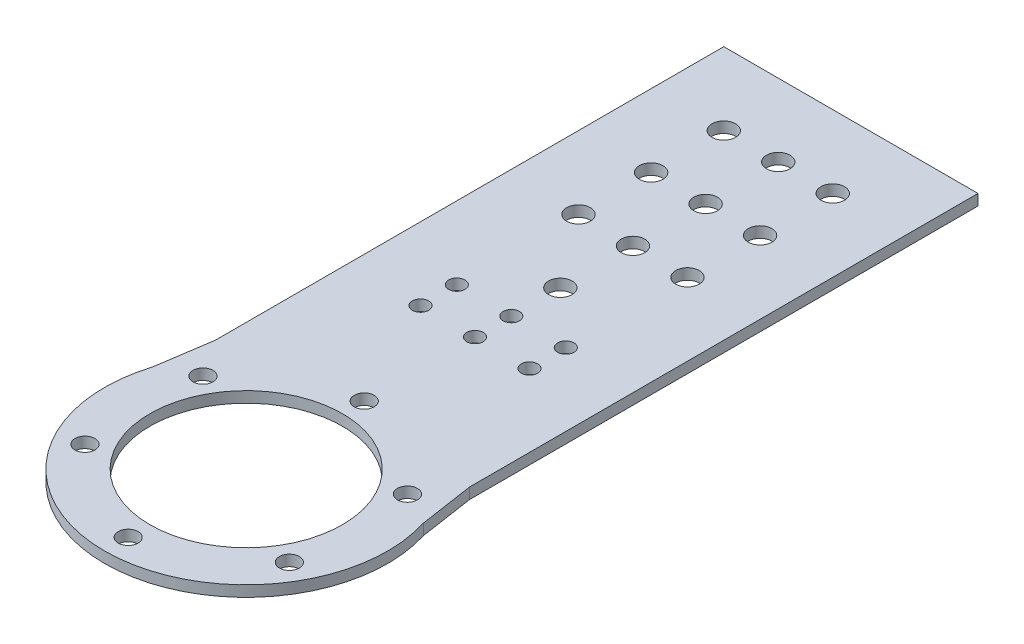
ISO-10303-21;
HEADER;
FILE_DESCRIPTION(('STEP AP214'),'2;1');
FILE_NAME('part.step','',(''),(''),'','','');
FILE_SCHEMA(('AUTOMOTIVE_DESIGN { 1 0 10303 214 1 1 1 1 }'));
ENDSEC;
DATA;
#1=APPLICATION_CONTEXT('core data for automotive mechanical design processes');
#2=APPLICATION_PROTOCOL_DEFINITION('international standard','automotive_design',2000,#1);
#3=PRODUCT_CONTEXT('',#1,'mechanical');
#4=PRODUCT('Part','Part','',(#3));
#5=PRODUCT_RELATED_PRODUCT_CATEGORY('part','',(#4));
#6=PRODUCT_DEFINITION_FORMATION('','',#4);
#7=PRODUCT_DEFINITION_CONTEXT('part definition',#1,'design');
#8=PRODUCT_DEFINITION('design','',#6,#7);
#9=PRODUCT_DEFINITION_SHAPE('','',#8);
#10=(LENGTH_UNIT() NAMED_UNIT(*) SI_UNIT(.MILLI.,.METRE.));
#11=(NAMED_UNIT(*) PLANE_ANGLE_UNIT() SI_UNIT($,.RADIAN.));
#12=(NAMED_UNIT(*) SI_UNIT($,.STERADIAN.) SOLID_ANGLE_UNIT());
#13=UNCERTAINTY_MEASURE_WITH_UNIT(LENGTH_MEASURE(1.E-05),#10,'distance_accuracy_value','');
#14=(GEOMETRIC_REPRESENTATION_CONTEXT(3) GLOBAL_UNCERTAINTY_ASSIGNED_CONTEXT((#13)) GLOBAL_UNIT_ASSIGNED_CONTEXT((#10,
#11,#12)) REPRESENTATION_CONTEXT('',''));
#15=CARTESIAN_POINT('',(0.,0.,0.));
#16=DIRECTION('',(0.,0.,1.));
#17=DIRECTION('',(1.,0.,0.));
#18=AXIS2_PLACEMENT_3D('',#15,#16,#17);
#19=CARTESIAN_POINT('',(0.,-8.5,-86.5000000000001));
#20=DIRECTION('',(0.,1.,0.));
#21=DIRECTION('',(0.,0.,1.));
#22=AXIS2_PLACEMENT_3D('',#19,#20,#21);
#23=CYLINDRICAL_SURFACE('',#22,3.25);
#24=CARTESIAN_POINT('',(0.,1.5,-86.5000000000001));
#25=DIRECTION('',(0.,1.,0.));
#26=DIRECTION('',(0.,0.,1.));
#27=AXIS2_PLACEMENT_3D('',#24,#25,#26);
#28=CIRCLE('',#27,3.25);
#29=CARTESIAN_POINT('',(0.,1.5,-83.2500000000001));
#30=VERTEX_POINT('',#29);
#31=EDGE_CURVE('E40',#30,#30,#28,.T.);
#32=ORIENTED_EDGE('',*,*,#31,.T.);
#33=EDGE_LOOP('',(#32));
#34=FACE_BOUND('',#33,.T.);
#35=CARTESIAN_POINT('',(0.,-1.5,-86.5000000000001));
#36=DIRECTION('',(0.,1.,0.));
#37=DIRECTION('',(0.,0.,1.));
#38=AXIS2_PLACEMENT_3D('',#35,#36,#37);
#39=CIRCLE('',#38,3.25);
#40=CARTESIAN_POINT('',(0.,-1.5,-83.2500000000001));
#41=VERTEX_POINT('',#40);
#42=EDGE_CURVE('E11',#41,#41,#39,.T.);
#43=ORIENTED_EDGE('',*,*,#42,.F.);
#44=EDGE_LOOP('',(#43));
#45=FACE_BOUND('',#44,.T.);
#46=ADVANCED_FACE('F33',(#34,#45),#23,.F.);
#47=CARTESIAN_POINT('',(0.,-8.5,-106.5));
#48=DIRECTION('',(0.,1.,0.));
#49=DIRECTION('',(0.,0.,1.));
#50=AXIS2_PLACEMENT_3D('',#47,#48,#49);
#51=CYLINDRICAL_SURFACE('',#50,3.25);
#52=CARTESIAN_POINT('',(0.,1.5,-106.5));
#53=DIRECTION('',(0.,1.,0.));
#54=DIRECTION('',(0.,0.,1.));
#55=AXIS2_PLACEMENT_3D('',#52,#53,#54);
#56=CIRCLE('',#55,3.25);
#57=CARTESIAN_POINT('',(0.,1.5,-103.25));
#58=VERTEX_POINT('',#57);
#59=EDGE_CURVE('E151',#58,#58,#56,.T.);
#60=ORIENTED_EDGE('',*,*,#59,.T.);
#61=EDGE_LOOP('',(#60));
#62=FACE_BOUND('',#61,.T.);
#63=CARTESIAN_POINT('',(0.,-1.5,-106.5));
#64=DIRECTION('',(0.,1.,0.));
#65=DIRECTION('',(0.,0.,1.));
#66=AXIS2_PLACEMENT_3D('',#63,#64,#65);
#67=CIRCLE('',#66,3.25);
#68=CARTESIAN_POINT('',(0.,-1.5,-103.25));
#69=VERTEX_POINT('',#68);
#70=EDGE_CURVE('E159',#69,#69,#67,.T.);
#71=ORIENTED_EDGE('',*,*,#70,.F.);
#72=EDGE_LOOP('',(#71));
#73=FACE_BOUND('',#72,.T.);
#74=ADVANCED_FACE('F185',(#62,#73),#51,.F.);
#75=CARTESIAN_POINT('',(15.,-1.5,-106.5));
#76=DIRECTION('',(0.,1.,0.));
#77=DIRECTION('',(0.,0.,1.));
#78=AXIS2_PLACEMENT_3D('',#75,#76,#77);
#79=CYLINDRICAL_SURFACE('',#78,3.25);
#80=CARTESIAN_POINT('',(15.,1.5,-106.5));
#81=DIRECTION('',(0.,1.,0.));
#82=DIRECTION('',(0.,0.,1.));
#83=AXIS2_PLACEMENT_3D('',#80,#81,#82);
#84=CIRCLE('',#83,3.25);
#85=CARTESIAN_POINT('',(15.,1.5,-103.25));
#86=VERTEX_POINT('',#85);
#87=EDGE_CURVE('E145',#86,#86,#84,.T.);
#88=ORIENTED_EDGE('',*,*,#87,.T.);
#89=EDGE_LOOP('',(#88));
#90=FACE_BOUND('',#89,.T.);
#91=CARTESIAN_POINT('',(15.,-1.5,-106.5));
#92=DIRECTION('',(0.,1.,0.));
#93=DIRECTION('',(0.,0.,1.));
#94=AXIS2_PLACEMENT_3D('',#91,#92,#93);
#95=CIRCLE('',#94,3.25);
#96=CARTESIAN_POINT('',(15.,-1.5,-103.25));
#97=VERTEX_POINT('',#96);
#98=EDGE_CURVE('E148',#97,#97,#95,.T.);
#99=ORIENTED_EDGE('',*,*,#98,.F.);
#100=EDGE_LOOP('',(#99));
#101=FACE_BOUND('',#100,.T.);
#102=ADVANCED_FACE('F190',(#90,#101),#79,.F.);
#103=CARTESIAN_POINT('',(-15.,-1.5,-106.5));
#104=DIRECTION('',(0.,1.,0.));
#105=DIRECTION('',(0.,0.,1.));
#106=AXIS2_PLACEMENT_3D('',#103,#104,#105);
#107=CYLINDRICAL_SURFACE('',#106,3.25);
#108=CARTESIAN_POINT('',(-15.,1.5,-106.5));
#109=DIRECTION('',(0.,1.,0.));
#110=DIRECTION('',(0.,0.,1.));
#111=AXIS2_PLACEMENT_3D('',#108,#109,#110);
#112=CIRCLE('',#111,3.25);
#113=CARTESIAN_POINT('',(-15.,1.5,-103.25));
#114=VERTEX_POINT('',#113);
#115=EDGE_CURVE('E139',#114,#114,#112,.T.);
#116=ORIENTED_EDGE('',*,*,#115,.T.);
#117=EDGE_LOOP('',(#116));
#118=FACE_BOUND('',#117,.T.);
#119=CARTESIAN_POINT('',(-15.,-1.5,-106.5));
#120=DIRECTION('',(0.,1.,0.));
#121=DIRECTION('',(0.,0.,1.));
#122=AXIS2_PLACEMENT_3D('',#119,#120,#121);
#123=CIRCLE('',#122,3.25);
#124=CARTESIAN_POINT('',(-15.,-1.5,-103.25));
#125=VERTEX_POINT('',#124);
#126=EDGE_CURVE('E142',#125,#125,#123,.T.);
#127=ORIENTED_EDGE('',*,*,#126,.F.);
#128=EDGE_LOOP('',(#127));
#129=FACE_BOUND('',#128,.T.);
#130=ADVANCED_FACE('F195',(#118,#129),#107,.F.);
#131=CARTESIAN_POINT('',(15.,-1.5,-63.));
#132=DIRECTION('',(0.,1.,0.));
#133=DIRECTION('',(0.,0.,1.));
#134=AXIS2_PLACEMENT_3D('',#131,#132,#133);
#135=CYLINDRICAL_SURFACE('',#134,2.25);
#136=CARTESIAN_POINT('',(15.,1.5,-63.));
#137=DIRECTION('',(0.,1.,0.));
#138=DIRECTION('',(0.,0.,1.));
#139=AXIS2_PLACEMENT_3D('',#136,#137,#138);
#140=CIRCLE('',#139,2.25);
#141=CARTESIAN_POINT('',(15.,1.5,-60.75));
#142=VERTEX_POINT('',#141);
#143=EDGE_CURVE('E133',#142,#142,#140,.T.);
#144=ORIENTED_EDGE('',*,*,#143,.T.);
#145=EDGE_LOOP('',(#144));
#146=FACE_BOUND('',#145,.T.);
#147=CARTESIAN_POINT('',(15.,-1.5,-63.));
#148=DIRECTION('',(0.,1.,0.));
#149=DIRECTION('',(0.,0.,1.));
#150=AXIS2_PLACEMENT_3D('',#147,#148,#149);
#151=CIRCLE('',#150,2.25);
#152=CARTESIAN_POINT('',(15.,-1.5,-60.75));
#153=VERTEX_POINT('',#152);
#154=EDGE_CURVE('E136',#153,#153,#151,.T.);
#155=ORIENTED_EDGE('',*,*,#154,.F.);
#156=EDGE_LOOP('',(#155));
#157=FACE_BOUND('',#156,.T.);
#158=ADVANCED_FACE('F202',(#146,#157),#135,.F.);
#159=CARTESIAN_POINT('',(0.,-1.5,-63.));
#160=DIRECTION('',(0.,1.,0.));
#161=DIRECTION('',(0.,0.,1.));
#162=AXIS2_PLACEMENT_3D('',#159,#160,#161);
#163=CYLINDRICAL_SURFACE('',#162,2.25);
#164=CARTESIAN_POINT('',(0.,1.5,-63.));
#165=DIRECTION('',(0.,1.,0.));
#166=DIRECTION('',(0.,0.,1.));
#167=AXIS2_PLACEMENT_3D('',#164,#165,#166);
#168=CIRCLE('',#167,2.25);
#169=CARTESIAN_POINT('',(0.,1.5,-60.75));
#170=VERTEX_POINT('',#169);
#171=EDGE_CURVE('E126',#170,#170,#168,.T.);
#172=ORIENTED_EDGE('',*,*,#171,.T.);
#173=EDGE_LOOP('',(#172));
#174=FACE_BOUND('',#173,.T.);
#175=CARTESIAN_POINT('',(0.,-1.5,-63.));
#176=DIRECTION('',(0.,1.,0.));
#177=DIRECTION('',(0.,0.,1.));
#178=AXIS2_PLACEMENT_3D('',#175,#176,#177);
#179=CIRCLE('',#178,2.25);
#180=CARTESIAN_POINT('',(0.,-1.5,-60.75));
#181=VERTEX_POINT('',#180);
#182=EDGE_CURVE('E130',#181,#181,#179,.T.);
#183=ORIENTED_EDGE('',*,*,#182,.F.);
#184=EDGE_LOOP('',(#183));
#185=FACE_BOUND('',#184,.T.);
#186=ADVANCED_FACE('F179',(#174,#185),#163,.F.);
#187=CARTESIAN_POINT('',(0.,1.5,0.));
#188=DIRECTION('',(0.,-1.,0.));
#189=DIRECTION('',(0.,0.,-1.));
#190=AXIS2_PLACEMENT_3D('',#187,#188,#189);
#191=CYLINDRICAL_SURFACE('',#190,39.);
#192=DIRECTION('',(0.,-1.,0.));
#193=VECTOR('',#192,1.);
#194=CARTESIAN_POINT('',(37.262443438914,1.5,-11.5113122171946));
#195=LINE('',#194,#193);
#196=CARTESIAN_POINT('',(37.2624434389141,1.5,-11.5113122171945));
#197=VERTEX_POINT('',#196);
#198=CARTESIAN_POINT('',(37.2624434389141,-1.5,-11.5113122171945));
#199=VERTEX_POINT('',#198);
#200=EDGE_CURVE('E108',#197,#199,#195,.T.);
#201=ORIENTED_EDGE('',*,*,#200,.F.);
#202=CARTESIAN_POINT('',(0.,1.5,0.));
#203=DIRECTION('',(0.,1.,0.));
#204=DIRECTION('',(0.,0.,1.));
#205=AXIS2_PLACEMENT_3D('',#202,#203,#204);
#206=CIRCLE('',#205,39.);
#207=CARTESIAN_POINT('',(-37.262443438914,1.5,-11.5113122171947));
#208=VERTEX_POINT('',#207);
#209=EDGE_CURVE('E47',#208,#197,#206,.T.);
#210=ORIENTED_EDGE('',*,*,#209,.F.);
#211=DIRECTION('',(0.,-1.,0.));
#212=VECTOR('',#211,1.);
#213=CARTESIAN_POINT('',(-37.262443438914,1.5,-11.5113122171947));
#214=LINE('',#213,#212);
#215=CARTESIAN_POINT('',(-37.262443438914,-1.5,-11.5113122171947));
#216=VERTEX_POINT('',#215);
#217=EDGE_CURVE('E111',#216,#208,#214,.F.);
#218=ORIENTED_EDGE('',*,*,#217,.F.);
#219=CARTESIAN_POINT('',(0.,-1.5,0.));
#220=DIRECTION('',(0.,1.,0.));
#221=DIRECTION('',(0.,0.,1.));
#222=AXIS2_PLACEMENT_3D('',#219,#220,#221);
#223=CIRCLE('',#222,39.);
#224=EDGE_CURVE('E122',#216,#199,#223,.T.);
#225=ORIENTED_EDGE('',*,*,#224,.T.);
#226=EDGE_LOOP('',(#201,#210,#218,#225));
#227=FACE_BOUND('',#226,.T.);
#228=ADVANCED_FACE('F168',(#227),#191,.T.);
#229=CARTESIAN_POINT('',(0.,1.5,0.));
#230=DIRECTION('',(0.,1.,0.));
#231=DIRECTION('',(0.,0.,1.));
#232=AXIS2_PLACEMENT_3D('',#229,#230,#231);
#233=PLANE('',#232);
#234=CARTESIAN_POINT('',(0.,1.5,-126.5));
#235=DIRECTION('',(0.,1.,0.));
#236=DIRECTION('',(0.,0.,1.));
#237=AXIS2_PLACEMENT_3D('',#234,#235,#236);
#238=CIRCLE('',#237,3.25);
#239=CARTESIAN_POINT('',(0.,1.5,-123.25));
#240=VERTEX_POINT('',#239);
#241=EDGE_CURVE('E443',#240,#240,#238,.T.);
#242=ORIENTED_EDGE('',*,*,#241,.F.);
#243=EDGE_LOOP('',(#242));
#244=FACE_BOUND('',#243,.T.);
#245=CARTESIAN_POINT('',(0.,1.5,-146.5));
#246=DIRECTION('',(0.,1.,0.));
#247=DIRECTION('',(0.,0.,1.));
#248=AXIS2_PLACEMENT_3D('',#245,#246,#247);
#249=CIRCLE('',#248,3.25);
#250=CARTESIAN_POINT('',(0.,1.5,-143.25));
#251=VERTEX_POINT('',#250);
#252=EDGE_CURVE('E156',#251,#251,#249,.T.);
#253=ORIENTED_EDGE('',*,*,#252,.F.);
#254=EDGE_LOOP('',(#253));
#255=FACE_BOUND('',#254,.T.);
#256=CARTESIAN_POINT('',(15.,1.5,-126.5));
#257=DIRECTION('',(0.,1.,0.));
#258=DIRECTION('',(0.,0.,1.));
#259=AXIS2_PLACEMENT_3D('',#256,#257,#258);
#260=CIRCLE('',#259,3.25);
#261=CARTESIAN_POINT('',(15.,1.5,-123.25));
#262=VERTEX_POINT('',#261);
#263=EDGE_CURVE('E155',#262,#262,#260,.T.);
#264=ORIENTED_EDGE('',*,*,#263,.F.);
#265=EDGE_LOOP('',(#264));
#266=FACE_BOUND('',#265,.T.);
#267=CARTESIAN_POINT('',(-15.,1.5,-126.5));
#268=DIRECTION('',(0.,1.,0.));
#269=DIRECTION('',(0.,0.,1.));
#270=AXIS2_PLACEMENT_3D('',#267,#268,#269);
#271=CIRCLE('',#270,3.25);
#272=CARTESIAN_POINT('',(-15.,1.5,-123.25));
#273=VERTEX_POINT('',#272);
#274=EDGE_CURVE('E457',#273,#273,#271,.T.);
#275=ORIENTED_EDGE('',*,*,#274,.F.);
#276=EDGE_LOOP('',(#275));
#277=FACE_BOUND('',#276,.T.);
#278=CARTESIAN_POINT('',(-15.,1.5,-146.5));
#279=DIRECTION('',(0.,1.,0.));
#280=DIRECTION('',(0.,0.,1.));
#281=AXIS2_PLACEMENT_3D('',#278,#279,#280);
#282=CIRCLE('',#281,3.25);
#283=CARTESIAN_POINT('',(-15.,1.5,-143.25));
#284=VERTEX_POINT('',#283);
#285=EDGE_CURVE('E472',#284,#284,#282,.T.);
#286=ORIENTED_EDGE('',*,*,#285,.F.);
#287=EDGE_LOOP('',(#286));
#288=FACE_BOUND('',#287,.T.);
#289=CARTESIAN_POINT('',(15.,1.5,-146.5));
#290=DIRECTION('',(0.,1.,0.));
#291=DIRECTION('',(0.,0.,1.));
#292=AXIS2_PLACEMENT_3D('',#289,#290,#291);
#293=CIRCLE('',#292,3.25);
#294=CARTESIAN_POINT('',(15.,1.5,-143.25));
#295=VERTEX_POINT('',#294);
#296=EDGE_CURVE('E467',#295,#295,#293,.T.);
#297=ORIENTED_EDGE('',*,*,#296,.F.);
#298=EDGE_LOOP('',(#297));
#299=FACE_BOUND('',#298,.T.);
#300=CARTESIAN_POINT('',(-15.,1.5,-73.));
#301=DIRECTION('',(0.,1.,0.));
#302=DIRECTION('',(0.,0.,1.));
#303=AXIS2_PLACEMENT_3D('',#300,#301,#302);
#304=CIRCLE('',#303,2.25);
#305=CARTESIAN_POINT('',(-15.,1.5,-70.75));
#306=VERTEX_POINT('',#305);
#307=EDGE_CURVE('E484',#306,#306,#304,.T.);
#308=ORIENTED_EDGE('',*,*,#307,.F.);
#309=EDGE_LOOP('',(#308));
#310=FACE_BOUND('',#309,.T.);
#311=CARTESIAN_POINT('',(-15.,1.5,-63.));
#312=DIRECTION('',(0.,1.,0.));
#313=DIRECTION('',(0.,0.,1.));
#314=AXIS2_PLACEMENT_3D('',#311,#312,#313);
#315=CIRCLE('',#314,2.25);
#316=CARTESIAN_POINT('',(-15.,1.5,-60.75));
#317=VERTEX_POINT('',#316);
#318=EDGE_CURVE('E479',#317,#317,#315,.T.);
#319=ORIENTED_EDGE('',*,*,#318,.F.);
#320=EDGE_LOOP('',(#319));
#321=FACE_BOUND('',#320,.T.);
#322=CARTESIAN_POINT('',(15.,1.5,-73.));
#323=DIRECTION('',(0.,1.,0.));
#324=DIRECTION('',(0.,0.,1.));
#325=AXIS2_PLACEMENT_3D('',#322,#323,#324);
#326=CIRCLE('',#325,2.25);
#327=CARTESIAN_POINT('',(15.,1.5,-70.75));
#328=VERTEX_POINT('',#327);
#329=EDGE_CURVE('E487',#328,#328,#326,.T.);
#330=ORIENTED_EDGE('',*,*,#329,.F.);
#331=EDGE_LOOP('',(#330));
#332=FACE_BOUND('',#331,.T.);
#333=CARTESIAN_POINT('',(0.,1.5,-73.));
#334=DIRECTION('',(0.,1.,0.));
#335=DIRECTION('',(0.,0.,1.));
#336=AXIS2_PLACEMENT_3D('',#333,#334,#335);
#337=CIRCLE('',#336,2.25);
#338=CARTESIAN_POINT('',(0.,1.5,-70.75));
#339=VERTEX_POINT('',#338);
#340=EDGE_CURVE('E496',#339,#339,#337,.T.);
#341=ORIENTED_EDGE('',*,*,#340,.F.);
#342=EDGE_LOOP('',(#341));
#343=FACE_BOUND('',#342,.T.);
#344=CARTESIAN_POINT('',(28.1458256229941,1.5,-16.2500000000003));
#345=DIRECTION('',(0.,1.,0.));
#346=DIRECTION('',(-0.866025403784433,0.,0.50000000000001));
#347=AXIS2_PLACEMENT_3D('',#344,#345,#346);
#348=CIRCLE('',#347,2.75);
#349=CARTESIAN_POINT('',(25.7642557625869,1.5,-14.8750000000003));
#350=VERTEX_POINT('',#349);
#351=EDGE_CURVE('E499',#350,#350,#348,.T.);
#352=ORIENTED_EDGE('',*,*,#351,.F.);
#353=EDGE_LOOP('',(#352));
#354=FACE_BOUND('',#353,.T.);
#355=CARTESIAN_POINT('',(28.1458256229944,1.5,16.2499999999997));
#356=DIRECTION('',(0.,1.,0.));
#357=DIRECTION('',(-0.866025403784443,0.,-0.499999999999992));
#358=AXIS2_PLACEMENT_3D('',#355,#356,#357);
#359=CIRCLE('',#358,2.75);
#360=CARTESIAN_POINT('',(25.7642557625872,1.5,14.8749999999998));
#361=VERTEX_POINT('',#360);
#362=EDGE_CURVE('E514',#361,#361,#359,.T.);
#363=ORIENTED_EDGE('',*,*,#362,.F.);
#364=EDGE_LOOP('',(#363));
#365=FACE_BOUND('',#364,.T.);
#366=CARTESIAN_POINT('',(0.,1.5,32.5));
#367=DIRECTION('',(0.,1.,0.));
#368=DIRECTION('',(0.,0.,-1.));
#369=AXIS2_PLACEMENT_3D('',#366,#367,#368);
#370=CIRCLE('',#369,2.75);
#371=CARTESIAN_POINT('',(0.,1.5,29.75));
#372=VERTEX_POINT('',#371);
#373=EDGE_CURVE('E508',#372,#372,#370,.T.);
#374=ORIENTED_EDGE('',*,*,#373,.F.);
#375=EDGE_LOOP('',(#374));
#376=FACE_BOUND('',#375,.T.);
#377=CARTESIAN_POINT('',(-28.1458256229942,1.5,16.2500000000001));
#378=DIRECTION('',(0.,1.,0.));
#379=DIRECTION('',(0.866025403784436,0.,-0.500000000000004));
#380=AXIS2_PLACEMENT_3D('',#377,#378,#379);
#381=CIRCLE('',#380,2.75);
#382=CARTESIAN_POINT('',(-25.764255762587,1.5,14.8750000000001));
#383=VERTEX_POINT('',#382);
#384=EDGE_CURVE('E500',#383,#383,#381,.T.);
#385=ORIENTED_EDGE('',*,*,#384,.F.);
#386=EDGE_LOOP('',(#385));
#387=FACE_BOUND('',#386,.T.);
#388=CARTESIAN_POINT('',(-28.1458256229943,1.5,-16.2499999999999));
#389=DIRECTION('',(0.,1.,0.));
#390=DIRECTION('',(0.86602540378444,0.,0.499999999999998));
#391=AXIS2_PLACEMENT_3D('',#388,#389,#390);
#392=CIRCLE('',#391,2.75);
#393=CARTESIAN_POINT('',(-25.7642557625871,1.5,-14.8749999999999));
#394=VERTEX_POINT('',#393);
#395=EDGE_CURVE('E507',#394,#394,#392,.T.);
#396=ORIENTED_EDGE('',*,*,#395,.F.);
#397=EDGE_LOOP('',(#396));
#398=FACE_BOUND('',#397,.T.);
#399=CARTESIAN_POINT('',(0.,1.5,-32.5));
#400=DIRECTION('',(0.,1.,0.));
#401=DIRECTION('',(0.,0.,1.));
#402=AXIS2_PLACEMENT_3D('',#399,#400,#401);
#403=CIRCLE('',#402,2.75);
#404=CARTESIAN_POINT('',(0.,1.5,-29.75));
#405=VERTEX_POINT('',#404);
#406=EDGE_CURVE('E529',#405,#405,#403,.T.);
#407=ORIENTED_EDGE('',*,*,#406,.F.);
#408=EDGE_LOOP('',(#407));
#409=FACE_BOUND('',#408,.T.);
#410=DIRECTION('',(-0.149252692330049,0.,0.988799086686588));
#411=VECTOR('',#410,1.);
#412=CARTESIAN_POINT('',(-35.,1.5,-26.5));
#413=LINE('',#412,#411);
#414=CARTESIAN_POINT('',(-35.,1.5,-26.5));
#415=VERTEX_POINT('',#414);
#416=EDGE_CURVE('E92',#415,#208,#413,.T.);
#417=ORIENTED_EDGE('',*,*,#416,.T.);
#418=ORIENTED_EDGE('',*,*,#209,.T.);
#419=DIRECTION('',(-0.149252692330051,0.,-0.988799086686588));
#420=VECTOR('',#419,1.);
#421=CARTESIAN_POINT('',(35.,1.5,-26.5));
#422=LINE('',#421,#420);
#423=CARTESIAN_POINT('',(35.,1.5,-26.5));
#424=VERTEX_POINT('',#423);
#425=EDGE_CURVE('E536',#197,#424,#422,.T.);
#426=ORIENTED_EDGE('',*,*,#425,.T.);
#427=DIRECTION('',(0.,0.,-1.));
#428=VECTOR('',#427,1.);
#429=CARTESIAN_POINT('',(35.,1.5,-166.5));
#430=LINE('',#429,#428);
#431=CARTESIAN_POINT('',(35.,1.5,-166.5));
#432=VERTEX_POINT('',#431);
#433=EDGE_CURVE('E99',#424,#432,#430,.T.);
#434=ORIENTED_EDGE('',*,*,#433,.T.);
#435=DIRECTION('',(-1.,0.,0.));
#436=VECTOR('',#435,1.);
#437=CARTESIAN_POINT('',(-35.,1.5,-166.5));
#438=LINE('',#437,#436);
#439=CARTESIAN_POINT('',(-35.,1.5,-166.5));
#440=VERTEX_POINT('',#439);
#441=EDGE_CURVE('E93',#432,#440,#438,.T.);
#442=ORIENTED_EDGE('',*,*,#441,.T.);
#443=DIRECTION('',(0.,0.,1.));
#444=VECTOR('',#443,1.);
#445=CARTESIAN_POINT('',(-35.,1.5,-166.5));
#446=LINE('',#445,#444);
#447=EDGE_CURVE('E83',#440,#415,#446,.T.);
#448=ORIENTED_EDGE('',*,*,#447,.T.);
#449=EDGE_LOOP('',(#417,#418,#426,#434,#442,#448));
#450=FACE_BOUND('',#449,.T.);
#451=CARTESIAN_POINT('',(0.,1.5,0.));
#452=DIRECTION('',(0.,1.,0.));
#453=DIRECTION('',(0.,0.,1.));
#454=AXIS2_PLACEMENT_3D('',#451,#452,#453);
#455=CIRCLE('',#454,26.5);
#456=CARTESIAN_POINT('',(0.,1.5,26.5));
#457=VERTEX_POINT('',#456);
#458=EDGE_CURVE('E119',#457,#457,#455,.T.);
#459=ORIENTED_EDGE('',*,*,#458,.F.);
#460=EDGE_LOOP('',(#459));
#461=FACE_BOUND('',#460,.T.);
#462=ORIENTED_EDGE('',*,*,#171,.F.);
#463=EDGE_LOOP('',(#462));
#464=FACE_BOUND('',#463,.T.);
#465=ORIENTED_EDGE('',*,*,#143,.F.);
#466=EDGE_LOOP('',(#465));
#467=FACE_BOUND('',#466,.T.);
#468=ORIENTED_EDGE('',*,*,#115,.F.);
#469=EDGE_LOOP('',(#468));
#470=FACE_BOUND('',#469,.T.);
#471=ORIENTED_EDGE('',*,*,#87,.F.);
#472=EDGE_LOOP('',(#471));
#473=FACE_BOUND('',#472,.T.);
#474=ORIENTED_EDGE('',*,*,#59,.F.);
#475=EDGE_LOOP('',(#474));
#476=FACE_BOUND('',#475,.T.);
#477=ORIENTED_EDGE('',*,*,#31,.F.);
#478=EDGE_LOOP('',(#477));
#479=FACE_BOUND('',#478,.T.);
#480=ADVANCED_FACE('F96',(#244,#255,#266,#277,#288,#299,#310,#321,#332,#343,#354,#365,#376,#387,
#398,#409,#450,#461,#464,#467,#470,#473,#476,#479),#233,.T.);
#481=CARTESIAN_POINT('',(0.,-1.5,0.));
#482=DIRECTION('',(0.,1.,0.));
#483=DIRECTION('',(0.,0.,1.));
#484=AXIS2_PLACEMENT_3D('',#481,#482,#483);
#485=PLANE('',#484);
#486=CARTESIAN_POINT('',(0.,-1.5,-126.5));
#487=DIRECTION('',(0.,1.,0.));
#488=DIRECTION('',(0.,0.,1.));
#489=AXIS2_PLACEMENT_3D('',#486,#487,#488);
#490=CIRCLE('',#489,3.25);
#491=CARTESIAN_POINT('',(0.,-1.5,-123.25));
#492=VERTEX_POINT('',#491);
#493=EDGE_CURVE('E446',#492,#492,#490,.T.);
#494=ORIENTED_EDGE('',*,*,#493,.T.);
#495=EDGE_LOOP('',(#494));
#496=FACE_BOUND('',#495,.T.);
#497=CARTESIAN_POINT('',(0.,-1.5,-146.5));
#498=DIRECTION('',(0.,1.,0.));
#499=DIRECTION('',(0.,0.,1.));
#500=AXIS2_PLACEMENT_3D('',#497,#498,#499);
#501=CIRCLE('',#500,3.25);
#502=CARTESIAN_POINT('',(0.,-1.5,-143.25));
#503=VERTEX_POINT('',#502);
#504=EDGE_CURVE('E152',#503,#503,#501,.T.);
#505=ORIENTED_EDGE('',*,*,#504,.T.);
#506=EDGE_LOOP('',(#505));
#507=FACE_BOUND('',#506,.T.);
#508=CARTESIAN_POINT('',(15.,-1.5,-126.5));
#509=DIRECTION('',(0.,1.,0.));
#510=DIRECTION('',(0.,0.,1.));
#511=AXIS2_PLACEMENT_3D('',#508,#509,#510);
#512=CIRCLE('',#511,3.25);
#513=CARTESIAN_POINT('',(15.,-1.5,-123.25));
#514=VERTEX_POINT('',#513);
#515=EDGE_CURVE('E454',#514,#514,#512,.T.);
#516=ORIENTED_EDGE('',*,*,#515,.T.);
#517=EDGE_LOOP('',(#516));
#518=FACE_BOUND('',#517,.T.);
#519=CARTESIAN_POINT('',(-15.,-1.5,-126.5));
#520=DIRECTION('',(0.,1.,0.));
#521=DIRECTION('',(0.,0.,1.));
#522=AXIS2_PLACEMENT_3D('',#519,#520,#521);
#523=CIRCLE('',#522,3.25);
#524=CARTESIAN_POINT('',(-15.,-1.5,-123.25));
#525=VERTEX_POINT('',#524);
#526=EDGE_CURVE('E460',#525,#525,#523,.T.);
#527=ORIENTED_EDGE('',*,*,#526,.T.);
#528=EDGE_LOOP('',(#527));
#529=FACE_BOUND('',#528,.T.);
#530=CARTESIAN_POINT('',(-15.,-1.5,-146.5));
#531=DIRECTION('',(0.,1.,0.));
#532=DIRECTION('',(0.,0.,1.));
#533=AXIS2_PLACEMENT_3D('',#530,#531,#532);
#534=CIRCLE('',#533,3.25);
#535=CARTESIAN_POINT('',(-15.,-1.5,-143.25));
#536=VERTEX_POINT('',#535);
#537=EDGE_CURVE('E464',#536,#536,#534,.T.);
#538=ORIENTED_EDGE('',*,*,#537,.T.);
#539=EDGE_LOOP('',(#538));
#540=FACE_BOUND('',#539,.T.);
#541=CARTESIAN_POINT('',(15.,-1.5,-146.5));
#542=DIRECTION('',(0.,1.,0.));
#543=DIRECTION('',(0.,0.,1.));
#544=AXIS2_PLACEMENT_3D('',#541,#542,#543);
#545=CIRCLE('',#544,3.25);
#546=CARTESIAN_POINT('',(15.,-1.5,-143.25));
#547=VERTEX_POINT('',#546);
#548=EDGE_CURVE('E463',#547,#547,#545,.T.);
#549=ORIENTED_EDGE('',*,*,#548,.T.);
#550=EDGE_LOOP('',(#549));
#551=FACE_BOUND('',#550,.T.);
#552=CARTESIAN_POINT('',(-15.,-1.5,-73.));
#553=DIRECTION('',(0.,1.,0.));
#554=DIRECTION('',(0.,0.,1.));
#555=AXIS2_PLACEMENT_3D('',#552,#553,#554);
#556=CIRCLE('',#555,2.25);
#557=CARTESIAN_POINT('',(-15.,-1.5,-70.75));
#558=VERTEX_POINT('',#557);
#559=EDGE_CURVE('E476',#558,#558,#556,.T.);
#560=ORIENTED_EDGE('',*,*,#559,.T.);
#561=EDGE_LOOP('',(#560));
#562=FACE_BOUND('',#561,.T.);
#563=CARTESIAN_POINT('',(-15.,-1.5,-63.));
#564=DIRECTION('',(0.,1.,0.));
#565=DIRECTION('',(0.,0.,1.));
#566=AXIS2_PLACEMENT_3D('',#563,#564,#565);
#567=CIRCLE('',#566,2.25);
#568=CARTESIAN_POINT('',(-15.,-1.5,-60.75));
#569=VERTEX_POINT('',#568);
#570=EDGE_CURVE('E475',#569,#569,#567,.T.);
#571=ORIENTED_EDGE('',*,*,#570,.T.);
#572=EDGE_LOOP('',(#571));
#573=FACE_BOUND('',#572,.T.);
#574=CARTESIAN_POINT('',(15.,-1.5,-73.));
#575=DIRECTION('',(0.,1.,0.));
#576=DIRECTION('',(0.,0.,1.));
#577=AXIS2_PLACEMENT_3D('',#574,#575,#576);
#578=CIRCLE('',#577,2.25);
#579=CARTESIAN_POINT('',(15.,-1.5,-70.75));
#580=VERTEX_POINT('',#579);
#581=EDGE_CURVE('E490',#580,#580,#578,.T.);
#582=ORIENTED_EDGE('',*,*,#581,.T.);
#583=EDGE_LOOP('',(#582));
#584=FACE_BOUND('',#583,.T.);
#585=CARTESIAN_POINT('',(0.,-1.5,-73.));
#586=DIRECTION('',(0.,1.,0.));
#587=DIRECTION('',(0.,0.,1.));
#588=AXIS2_PLACEMENT_3D('',#585,#586,#587);
#589=CIRCLE('',#588,2.25);
#590=CARTESIAN_POINT('',(0.,-1.5,-70.75));
#591=VERTEX_POINT('',#590);
#592=EDGE_CURVE('E493',#591,#591,#589,.T.);
#593=ORIENTED_EDGE('',*,*,#592,.T.);
#594=EDGE_LOOP('',(#593));
#595=FACE_BOUND('',#594,.T.);
#596=CARTESIAN_POINT('',(28.1458256229941,-1.5,-16.2500000000003));
#597=DIRECTION('',(0.,1.,0.));
#598=DIRECTION('',(-0.866025403784433,0.,0.50000000000001));
#599=AXIS2_PLACEMENT_3D('',#596,#597,#598);
#600=CIRCLE('',#599,2.75);
#601=CARTESIAN_POINT('',(25.7642557625869,-1.5,-14.8750000000003));
#602=VERTEX_POINT('',#601);
#603=EDGE_CURVE('E517',#602,#602,#600,.T.);
#604=ORIENTED_EDGE('',*,*,#603,.T.);
#605=EDGE_LOOP('',(#604));
#606=FACE_BOUND('',#605,.T.);
#607=CARTESIAN_POINT('',(28.1458256229944,-1.5,16.2499999999997));
#608=DIRECTION('',(0.,1.,0.));
#609=DIRECTION('',(-0.866025403784443,0.,-0.499999999999992));
#610=AXIS2_PLACEMENT_3D('',#607,#608,#609);
#611=CIRCLE('',#610,2.75);
#612=CARTESIAN_POINT('',(25.7642557625872,-1.5,14.8749999999998));
#613=VERTEX_POINT('',#612);
#614=EDGE_CURVE('E511',#613,#613,#611,.T.);
#615=ORIENTED_EDGE('',*,*,#614,.T.);
#616=EDGE_LOOP('',(#615));
#617=FACE_BOUND('',#616,.T.);
#618=CARTESIAN_POINT('',(0.,-1.5,32.5));
#619=DIRECTION('',(0.,1.,0.));
#620=DIRECTION('',(0.,0.,-1.));
#621=AXIS2_PLACEMENT_3D('',#618,#619,#620);
#622=CIRCLE('',#621,2.75);
#623=CARTESIAN_POINT('',(0.,-1.5,29.75));
#624=VERTEX_POINT('',#623);
#625=EDGE_CURVE('E504',#624,#624,#622,.T.);
#626=ORIENTED_EDGE('',*,*,#625,.T.);
#627=EDGE_LOOP('',(#626));
#628=FACE_BOUND('',#627,.T.);
#629=CARTESIAN_POINT('',(-28.1458256229942,-1.5,16.2500000000001));
#630=DIRECTION('',(0.,1.,0.));
#631=DIRECTION('',(0.866025403784436,0.,-0.500000000000004));
#632=AXIS2_PLACEMENT_3D('',#629,#630,#631);
#633=CIRCLE('',#632,2.75);
#634=CARTESIAN_POINT('',(-25.764255762587,-1.5,14.8750000000001));
#635=VERTEX_POINT('',#634);
#636=EDGE_CURVE('E503',#635,#635,#633,.T.);
#637=ORIENTED_EDGE('',*,*,#636,.T.);
#638=EDGE_LOOP('',(#637));
#639=FACE_BOUND('',#638,.T.);
#640=CARTESIAN_POINT('',(-28.1458256229943,-1.5,-16.2499999999999));
#641=DIRECTION('',(0.,1.,0.));
#642=DIRECTION('',(0.86602540378444,0.,0.499999999999998));
#643=AXIS2_PLACEMENT_3D('',#640,#641,#642);
#644=CIRCLE('',#643,2.75);
#645=CARTESIAN_POINT('',(-25.7642557625871,-1.5,-14.8749999999999));
#646=VERTEX_POINT('',#645);
#647=EDGE_CURVE('E526',#646,#646,#644,.T.);
#648=ORIENTED_EDGE('',*,*,#647,.T.);
#649=EDGE_LOOP('',(#648));
#650=FACE_BOUND('',#649,.T.);
#651=CARTESIAN_POINT('',(0.,-1.5,-32.5));
#652=DIRECTION('',(0.,1.,0.));
#653=DIRECTION('',(0.,0.,1.));
#654=AXIS2_PLACEMENT_3D('',#651,#652,#653);
#655=CIRCLE('',#654,2.75);
#656=CARTESIAN_POINT('',(0.,-1.5,-29.75));
#657=VERTEX_POINT('',#656);
#658=EDGE_CURVE('E532',#657,#657,#655,.T.);
#659=ORIENTED_EDGE('',*,*,#658,.T.);
#660=EDGE_LOOP('',(#659));
#661=FACE_BOUND('',#660,.T.);
#662=ORIENTED_EDGE('',*,*,#224,.F.);
#663=DIRECTION('',(-0.149252692330049,0.,0.988799086686588));
#664=VECTOR('',#663,1.);
#665=CARTESIAN_POINT('',(-35.,-1.5,-26.5));
#666=LINE('',#665,#664);
#667=CARTESIAN_POINT('',(-35.,-1.5,-26.5));
#668=VERTEX_POINT('',#667);
#669=EDGE_CURVE('E543',#668,#216,#666,.T.);
#670=ORIENTED_EDGE('',*,*,#669,.F.);
#671=DIRECTION('',(0.,0.,1.));
#672=VECTOR('',#671,1.);
#673=CARTESIAN_POINT('',(-35.,-1.5,-166.5));
#674=LINE('',#673,#672);
#675=CARTESIAN_POINT('',(-35.,-1.5,-166.5));
#676=VERTEX_POINT('',#675);
#677=EDGE_CURVE('E541',#676,#668,#674,.T.);
#678=ORIENTED_EDGE('',*,*,#677,.F.);
#679=DIRECTION('',(-1.,0.,0.));
#680=VECTOR('',#679,1.);
#681=CARTESIAN_POINT('',(-35.,-1.5,-166.5));
#682=LINE('',#681,#680);
#683=CARTESIAN_POINT('',(35.,-1.5,-166.5));
#684=VERTEX_POINT('',#683);
#685=EDGE_CURVE('E107',#684,#676,#682,.T.);
#686=ORIENTED_EDGE('',*,*,#685,.F.);
#687=DIRECTION('',(0.,0.,-1.));
#688=VECTOR('',#687,1.);
#689=CARTESIAN_POINT('',(35.,-1.5,-166.5));
#690=LINE('',#689,#688);
#691=CARTESIAN_POINT('',(35.,-1.5,-26.5));
#692=VERTEX_POINT('',#691);
#693=EDGE_CURVE('E103',#692,#684,#690,.T.);
#694=ORIENTED_EDGE('',*,*,#693,.F.);
#695=DIRECTION('',(-0.149252692330051,0.,-0.988799086686588));
#696=VECTOR('',#695,1.);
#697=CARTESIAN_POINT('',(35.,-1.5,-26.5));
#698=LINE('',#697,#696);
#699=EDGE_CURVE('E546',#199,#692,#698,.T.);
#700=ORIENTED_EDGE('',*,*,#699,.F.);
#701=EDGE_LOOP('',(#662,#670,#678,#686,#694,#700));
#702=FACE_BOUND('',#701,.T.);
#703=CARTESIAN_POINT('',(0.,-1.5,0.));
#704=DIRECTION('',(0.,1.,0.));
#705=DIRECTION('',(0.,0.,1.));
#706=AXIS2_PLACEMENT_3D('',#703,#704,#705);
#707=CIRCLE('',#706,26.5);
#708=CARTESIAN_POINT('',(0.,-1.5,26.5));
#709=VERTEX_POINT('',#708);
#710=EDGE_CURVE('E118',#709,#709,#707,.T.);
#711=ORIENTED_EDGE('',*,*,#710,.T.);
#712=EDGE_LOOP('',(#711));
#713=FACE_BOUND('',#712,.T.);
#714=ORIENTED_EDGE('',*,*,#182,.T.);
#715=EDGE_LOOP('',(#714));
#716=FACE_BOUND('',#715,.T.);
#717=ORIENTED_EDGE('',*,*,#154,.T.);
#718=EDGE_LOOP('',(#717));
#719=FACE_BOUND('',#718,.T.);
#720=ORIENTED_EDGE('',*,*,#126,.T.);
#721=EDGE_LOOP('',(#720));
#722=FACE_BOUND('',#721,.T.);
#723=ORIENTED_EDGE('',*,*,#98,.T.);
#724=EDGE_LOOP('',(#723));
#725=FACE_BOUND('',#724,.T.);
#726=ORIENTED_EDGE('',*,*,#70,.T.);
#727=EDGE_LOOP('',(#726));
#728=FACE_BOUND('',#727,.T.);
#729=ORIENTED_EDGE('',*,*,#42,.T.);
#730=EDGE_LOOP('',(#729));
#731=FACE_BOUND('',#730,.T.);
#732=ADVANCED_FACE('F167',(#496,#507,#518,#529,#540,#551,#562,#573,#584,#595,#606,#617,#628,
#639,#650,#661,#702,#713,#716,#719,#722,#725,#728,#731),#485,.F.);
#733=CARTESIAN_POINT('',(0.,1.5,0.));
#734=DIRECTION('',(0.,-1.,0.));
#735=DIRECTION('',(0.,0.,-1.));
#736=AXIS2_PLACEMENT_3D('',#733,#734,#735);
#737=CYLINDRICAL_SURFACE('',#736,26.5);
#738=ORIENTED_EDGE('',*,*,#710,.F.);
#739=EDGE_LOOP('',(#738));
#740=FACE_BOUND('',#739,.T.);
#741=ORIENTED_EDGE('',*,*,#458,.T.);
#742=EDGE_LOOP('',(#741));
#743=FACE_BOUND('',#742,.T.);
#744=ADVANCED_FACE('F175',(#740,#743),#737,.F.);
#745=CARTESIAN_POINT('',(-35.,1.5,-26.5));
#746=DIRECTION('',(0.988799086686589,0.,0.149252692330049));
#747=DIRECTION('',(0.149252692330049,0.,-0.988799086686589));
#748=AXIS2_PLACEMENT_3D('',#745,#746,#747);
#749=PLANE('',#748);
#750=ORIENTED_EDGE('',*,*,#669,.T.);
#751=ORIENTED_EDGE('',*,*,#217,.T.);
#752=ORIENTED_EDGE('',*,*,#416,.F.);
#753=DIRECTION('',(0.,-1.,0.));
#754=VECTOR('',#753,1.);
#755=CARTESIAN_POINT('',(-35.,1.5,-26.5));
#756=LINE('',#755,#754);
#757=EDGE_CURVE('E90',#415,#668,#756,.T.);
#758=ORIENTED_EDGE('',*,*,#757,.T.);
#759=EDGE_LOOP('',(#750,#751,#752,#758));
#760=FACE_BOUND('',#759,.T.);
#761=ADVANCED_FACE('F264',(#760),#749,.F.);
#762=CARTESIAN_POINT('',(35.,1.5,-26.5));
#763=DIRECTION('',(-0.988799086686588,0.,0.149252692330051));
#764=DIRECTION('',(0.149252692330051,0.,0.988799086686588));
#765=AXIS2_PLACEMENT_3D('',#762,#763,#764);
#766=PLANE('',#765);
#767=ORIENTED_EDGE('',*,*,#425,.F.);
#768=ORIENTED_EDGE('',*,*,#200,.T.);
#769=ORIENTED_EDGE('',*,*,#699,.T.);
#770=DIRECTION('',(0.,-1.,0.));
#771=VECTOR('',#770,1.);
#772=CARTESIAN_POINT('',(35.,1.5,-26.5));
#773=LINE('',#772,#771);
#774=EDGE_CURVE('E113',#424,#692,#773,.T.);
#775=ORIENTED_EDGE('',*,*,#774,.F.);
#776=EDGE_LOOP('',(#767,#768,#769,#775));
#777=FACE_BOUND('',#776,.T.);
#778=ADVANCED_FACE('F271',(#777),#766,.F.);
#779=CARTESIAN_POINT('',(-35.,1.5,-166.5));
#780=DIRECTION('',(0.,0.,1.));
#781=DIRECTION('',(1.,0.,0.));
#782=AXIS2_PLACEMENT_3D('',#779,#780,#781);
#783=PLANE('',#782);
#784=ORIENTED_EDGE('',*,*,#685,.T.);
#785=DIRECTION('',(0.,-1.,0.));
#786=VECTOR('',#785,1.);
#787=CARTESIAN_POINT('',(-35.,1.5,-166.5));
#788=LINE('',#787,#786);
#789=EDGE_CURVE('E87',#440,#676,#788,.T.);
#790=ORIENTED_EDGE('',*,*,#789,.F.);
#791=ORIENTED_EDGE('',*,*,#441,.F.);
#792=DIRECTION('',(0.,-1.,0.));
#793=VECTOR('',#792,1.);
#794=CARTESIAN_POINT('',(35.,1.5,-166.5));
#795=LINE('',#794,#793);
#796=EDGE_CURVE('E539',#432,#684,#795,.T.);
#797=ORIENTED_EDGE('',*,*,#796,.T.);
#798=EDGE_LOOP('',(#784,#790,#791,#797));
#799=FACE_BOUND('',#798,.T.);
#800=ADVANCED_FACE('F105',(#799),#783,.F.);
#801=CARTESIAN_POINT('',(-35.,1.5,-166.5));
#802=DIRECTION('',(1.,0.,0.));
#803=DIRECTION('',(0.,0.,-1.));
#804=AXIS2_PLACEMENT_3D('',#801,#802,#803);
#805=PLANE('',#804);
#806=ORIENTED_EDGE('',*,*,#677,.T.);
#807=ORIENTED_EDGE('',*,*,#757,.F.);
#808=ORIENTED_EDGE('',*,*,#447,.F.);
#809=ORIENTED_EDGE('',*,*,#789,.T.);
#810=EDGE_LOOP('',(#806,#807,#808,#809));
#811=FACE_BOUND('',#810,.T.);
#812=ADVANCED_FACE('F85',(#811),#805,.F.);
#813=CARTESIAN_POINT('',(35.,1.5,-166.5));
#814=DIRECTION('',(-1.,0.,0.));
#815=DIRECTION('',(0.,0.,1.));
#816=AXIS2_PLACEMENT_3D('',#813,#814,#815);
#817=PLANE('',#816);
#818=ORIENTED_EDGE('',*,*,#693,.T.);
#819=ORIENTED_EDGE('',*,*,#796,.F.);
#820=ORIENTED_EDGE('',*,*,#433,.F.);
#821=ORIENTED_EDGE('',*,*,#774,.T.);
#822=EDGE_LOOP('',(#818,#819,#820,#821));
#823=FACE_BOUND('',#822,.T.);
#824=ADVANCED_FACE('F291',(#823),#817,.F.);
#825=CARTESIAN_POINT('',(0.,-1.5,-32.5));
#826=DIRECTION('',(0.,1.,0.));
#827=DIRECTION('',(0.,0.,1.));
#828=AXIS2_PLACEMENT_3D('',#825,#826,#827);
#829=CYLINDRICAL_SURFACE('',#828,2.75);
#830=ORIENTED_EDGE('',*,*,#658,.F.);
#831=EDGE_LOOP('',(#830));
#832=FACE_BOUND('',#831,.T.);
#833=ORIENTED_EDGE('',*,*,#406,.T.);
#834=EDGE_LOOP('',(#833));
#835=FACE_BOUND('',#834,.T.);
#836=ADVANCED_FACE('F298',(#832,#835),#829,.F.);
#837=CARTESIAN_POINT('',(-28.1458256229943,-1.5,-16.2499999999999));
#838=DIRECTION('',(0.,1.,0.));
#839=DIRECTION('',(0.,0.,1.));
#840=AXIS2_PLACEMENT_3D('',#837,#838,#839);
#841=CYLINDRICAL_SURFACE('',#840,2.75);
#842=ORIENTED_EDGE('',*,*,#647,.F.);
#843=EDGE_LOOP('',(#842));
#844=FACE_BOUND('',#843,.T.);
#845=ORIENTED_EDGE('',*,*,#395,.T.);
#846=EDGE_LOOP('',(#845));
#847=FACE_BOUND('',#846,.T.);
#848=ADVANCED_FACE('F306',(#844,#847),#841,.F.);
#849=CARTESIAN_POINT('',(-28.1458256229942,-1.5,16.2500000000001));
#850=DIRECTION('',(0.,1.,0.));
#851=DIRECTION('',(0.,0.,1.));
#852=AXIS2_PLACEMENT_3D('',#849,#850,#851);
#853=CYLINDRICAL_SURFACE('',#852,2.75);
#854=ORIENTED_EDGE('',*,*,#636,.F.);
#855=EDGE_LOOP('',(#854));
#856=FACE_BOUND('',#855,.T.);
#857=ORIENTED_EDGE('',*,*,#384,.T.);
#858=EDGE_LOOP('',(#857));
#859=FACE_BOUND('',#858,.T.);
#860=ADVANCED_FACE('F314',(#856,#859),#853,.F.);
#861=CARTESIAN_POINT('',(0.,-1.5,32.5));
#862=DIRECTION('',(0.,1.,0.));
#863=DIRECTION('',(0.,0.,1.));
#864=AXIS2_PLACEMENT_3D('',#861,#862,#863);
#865=CYLINDRICAL_SURFACE('',#864,2.75);
#866=ORIENTED_EDGE('',*,*,#625,.F.);
#867=EDGE_LOOP('',(#866));
#868=FACE_BOUND('',#867,.T.);
#869=ORIENTED_EDGE('',*,*,#373,.T.);
#870=EDGE_LOOP('',(#869));
#871=FACE_BOUND('',#870,.T.);
#872=ADVANCED_FACE('F322',(#868,#871),#865,.F.);
#873=CARTESIAN_POINT('',(28.1458256229944,-1.5,16.2499999999997));
#874=DIRECTION('',(0.,1.,0.));
#875=DIRECTION('',(0.,0.,1.));
#876=AXIS2_PLACEMENT_3D('',#873,#874,#875);
#877=CYLINDRICAL_SURFACE('',#876,2.75);
#878=ORIENTED_EDGE('',*,*,#614,.F.);
#879=EDGE_LOOP('',(#878));
#880=FACE_BOUND('',#879,.T.);
#881=ORIENTED_EDGE('',*,*,#362,.T.);
#882=EDGE_LOOP('',(#881));
#883=FACE_BOUND('',#882,.T.);
#884=ADVANCED_FACE('F330',(#880,#883),#877,.F.);
#885=CARTESIAN_POINT('',(28.1458256229941,-1.5,-16.2500000000003));
#886=DIRECTION('',(0.,1.,0.));
#887=DIRECTION('',(0.,0.,1.));
#888=AXIS2_PLACEMENT_3D('',#885,#886,#887);
#889=CYLINDRICAL_SURFACE('',#888,2.75);
#890=ORIENTED_EDGE('',*,*,#603,.F.);
#891=EDGE_LOOP('',(#890));
#892=FACE_BOUND('',#891,.T.);
#893=ORIENTED_EDGE('',*,*,#351,.T.);
#894=EDGE_LOOP('',(#893));
#895=FACE_BOUND('',#894,.T.);
#896=ADVANCED_FACE('F338',(#892,#895),#889,.F.);
#897=CARTESIAN_POINT('',(0.,-1.5,-73.));
#898=DIRECTION('',(0.,1.,0.));
#899=DIRECTION('',(0.,0.,1.));
#900=AXIS2_PLACEMENT_3D('',#897,#898,#899);
#901=CYLINDRICAL_SURFACE('',#900,2.25);
#902=ORIENTED_EDGE('',*,*,#340,.T.);
#903=EDGE_LOOP('',(#902));
#904=FACE_BOUND('',#903,.T.);
#905=ORIENTED_EDGE('',*,*,#592,.F.);
#906=EDGE_LOOP('',(#905));
#907=FACE_BOUND('',#906,.T.);
#908=ADVANCED_FACE('F346',(#904,#907),#901,.F.);
#909=CARTESIAN_POINT('',(15.,-1.5,-73.));
#910=DIRECTION('',(0.,1.,0.));
#911=DIRECTION('',(0.,0.,1.));
#912=AXIS2_PLACEMENT_3D('',#909,#910,#911);
#913=CYLINDRICAL_SURFACE('',#912,2.25);
#914=ORIENTED_EDGE('',*,*,#329,.T.);
#915=EDGE_LOOP('',(#914));
#916=FACE_BOUND('',#915,.T.);
#917=ORIENTED_EDGE('',*,*,#581,.F.);
#918=EDGE_LOOP('',(#917));
#919=FACE_BOUND('',#918,.T.);
#920=ADVANCED_FACE('F354',(#916,#919),#913,.F.);
#921=CARTESIAN_POINT('',(-15.,-1.5,-63.));
#922=DIRECTION('',(0.,1.,0.));
#923=DIRECTION('',(0.,0.,1.));
#924=AXIS2_PLACEMENT_3D('',#921,#922,#923);
#925=CYLINDRICAL_SURFACE('',#924,2.25);
#926=ORIENTED_EDGE('',*,*,#318,.T.);
#927=EDGE_LOOP('',(#926));
#928=FACE_BOUND('',#927,.T.);
#929=ORIENTED_EDGE('',*,*,#570,.F.);
#930=EDGE_LOOP('',(#929));
#931=FACE_BOUND('',#930,.T.);
#932=ADVANCED_FACE('F361',(#928,#931),#925,.F.);
#933=CARTESIAN_POINT('',(-15.,-1.5,-73.));
#934=DIRECTION('',(0.,1.,0.));
#935=DIRECTION('',(0.,0.,1.));
#936=AXIS2_PLACEMENT_3D('',#933,#934,#935);
#937=CYLINDRICAL_SURFACE('',#936,2.25);
#938=ORIENTED_EDGE('',*,*,#307,.T.);
#939=EDGE_LOOP('',(#938));
#940=FACE_BOUND('',#939,.T.);
#941=ORIENTED_EDGE('',*,*,#559,.F.);
#942=EDGE_LOOP('',(#941));
#943=FACE_BOUND('',#942,.T.);
#944=ADVANCED_FACE('F369',(#940,#943),#937,.F.);
#945=CARTESIAN_POINT('',(15.,-1.5,-146.5));
#946=DIRECTION('',(0.,1.,0.));
#947=DIRECTION('',(0.,0.,1.));
#948=AXIS2_PLACEMENT_3D('',#945,#946,#947);
#949=CYLINDRICAL_SURFACE('',#948,3.25);
#950=ORIENTED_EDGE('',*,*,#296,.T.);
#951=EDGE_LOOP('',(#950));
#952=FACE_BOUND('',#951,.T.);
#953=ORIENTED_EDGE('',*,*,#548,.F.);
#954=EDGE_LOOP('',(#953));
#955=FACE_BOUND('',#954,.T.);
#956=ADVANCED_FACE('F377',(#952,#955),#949,.F.);
#957=CARTESIAN_POINT('',(-15.,-1.5,-146.5));
#958=DIRECTION('',(0.,1.,0.));
#959=DIRECTION('',(0.,0.,1.));
#960=AXIS2_PLACEMENT_3D('',#957,#958,#959);
#961=CYLINDRICAL_SURFACE('',#960,3.25);
#962=ORIENTED_EDGE('',*,*,#285,.T.);
#963=EDGE_LOOP('',(#962));
#964=FACE_BOUND('',#963,.T.);
#965=ORIENTED_EDGE('',*,*,#537,.F.);
#966=EDGE_LOOP('',(#965));
#967=FACE_BOUND('',#966,.T.);
#968=ADVANCED_FACE('F385',(#964,#967),#961,.F.);
#969=CARTESIAN_POINT('',(-15.,-1.5,-126.5));
#970=DIRECTION('',(0.,1.,0.));
#971=DIRECTION('',(0.,0.,1.));
#972=AXIS2_PLACEMENT_3D('',#969,#970,#971);
#973=CYLINDRICAL_SURFACE('',#972,3.25);
#974=ORIENTED_EDGE('',*,*,#274,.T.);
#975=EDGE_LOOP('',(#974));
#976=FACE_BOUND('',#975,.T.);
#977=ORIENTED_EDGE('',*,*,#526,.F.);
#978=EDGE_LOOP('',(#977));
#979=FACE_BOUND('',#978,.T.);
#980=ADVANCED_FACE('F393',(#976,#979),#973,.F.);
#981=CARTESIAN_POINT('',(15.,-1.5,-126.5));
#982=DIRECTION('',(0.,1.,0.));
#983=DIRECTION('',(0.,0.,1.));
#984=AXIS2_PLACEMENT_3D('',#981,#982,#983);
#985=CYLINDRICAL_SURFACE('',#984,3.25);
#986=ORIENTED_EDGE('',*,*,#263,.T.);
#987=EDGE_LOOP('',(#986));
#988=FACE_BOUND('',#987,.T.);
#989=ORIENTED_EDGE('',*,*,#515,.F.);
#990=EDGE_LOOP('',(#989));
#991=FACE_BOUND('',#990,.T.);
#992=ADVANCED_FACE('F401',(#988,#991),#985,.F.);
#993=CARTESIAN_POINT('',(0.,-8.5,-146.5));
#994=DIRECTION('',(0.,1.,0.));
#995=DIRECTION('',(0.,0.,1.));
#996=AXIS2_PLACEMENT_3D('',#993,#994,#995);
#997=CYLINDRICAL_SURFACE('',#996,3.25);
#998=ORIENTED_EDGE('',*,*,#252,.T.);
#999=EDGE_LOOP('',(#998));
#1000=FACE_BOUND('',#999,.T.);
#1001=ORIENTED_EDGE('',*,*,#504,.F.);
#1002=EDGE_LOOP('',(#1001));
#1003=FACE_BOUND('',#1002,.T.);
#1004=ADVANCED_FACE('F409',(#1000,#1003),#997,.F.);
#1005=CARTESIAN_POINT('',(0.,-8.5,-126.5));
#1006=DIRECTION('',(0.,1.,0.));
#1007=DIRECTION('',(0.,0.,1.));
#1008=AXIS2_PLACEMENT_3D('',#1005,#1006,#1007);
#1009=CYLINDRICAL_SURFACE('',#1008,3.25);
#1010=ORIENTED_EDGE('',*,*,#241,.T.);
#1011=EDGE_LOOP('',(#1010));
#1012=FACE_BOUND('',#1011,.T.);
#1013=ORIENTED_EDGE('',*,*,#493,.F.);
#1014=EDGE_LOOP('',(#1013));
#1015=FACE_BOUND('',#1014,.T.);
#1016=ADVANCED_FACE('F419',(#1012,#1015),#1009,.F.);
#1017=CLOSED_SHELL('',(#46,#74,#102,#130,#158,#186,#228,#480,#732,#744,#761,#778,#800,#812,#824,
#836,#848,#860,#872,#884,#896,#908,#920,#932,#944,#956,#968,#980,#992,#1004,#1016));
#1018=MANIFOLD_SOLID_BREP('B2',#1017);
#1019=ADVANCED_BREP_SHAPE_REPRESENTATION('',(#18,#1018),#14);
#1020=SHAPE_DEFINITION_REPRESENTATION(#9,#1019);
ENDSEC;
END-ISO-10303-21;
